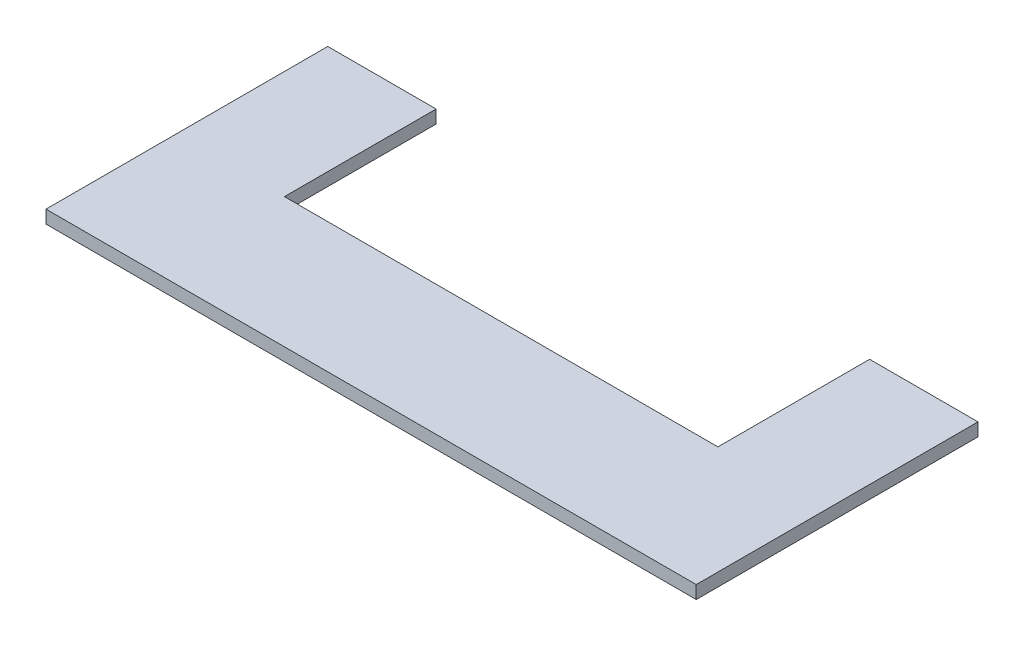
ISO-10303-21;
HEADER;
FILE_DESCRIPTION(('STEP AP214'),'2;1');
FILE_NAME('part.step','',(''),(''),'','','');
FILE_SCHEMA(('AUTOMOTIVE_DESIGN { 1 0 10303 214 1 1 1 1 }'));
ENDSEC;
DATA;
#1=APPLICATION_CONTEXT('core data for automotive mechanical design processes');
#2=APPLICATION_PROTOCOL_DEFINITION('international standard','automotive_design',2000,#1);
#3=PRODUCT_CONTEXT('',#1,'mechanical');
#4=PRODUCT('Part','Part','',(#3));
#5=PRODUCT_RELATED_PRODUCT_CATEGORY('part','',(#4));
#6=PRODUCT_DEFINITION_FORMATION('','',#4);
#7=PRODUCT_DEFINITION_CONTEXT('part definition',#1,'design');
#8=PRODUCT_DEFINITION('design','',#6,#7);
#9=PRODUCT_DEFINITION_SHAPE('','',#8);
#10=(LENGTH_UNIT() NAMED_UNIT(*) SI_UNIT(.MILLI.,.METRE.));
#11=(NAMED_UNIT(*) PLANE_ANGLE_UNIT() SI_UNIT($,.RADIAN.));
#12=(NAMED_UNIT(*) SI_UNIT($,.STERADIAN.) SOLID_ANGLE_UNIT());
#13=UNCERTAINTY_MEASURE_WITH_UNIT(LENGTH_MEASURE(1.E-05),#10,'distance_accuracy_value','');
#14=(GEOMETRIC_REPRESENTATION_CONTEXT(3) GLOBAL_UNCERTAINTY_ASSIGNED_CONTEXT((#13)) GLOBAL_UNIT_ASSIGNED_CONTEXT((#10,
#11,#12)) REPRESENTATION_CONTEXT('',''));
#15=CARTESIAN_POINT('',(0.,0.,0.));
#16=DIRECTION('',(0.,0.,1.));
#17=DIRECTION('',(1.,0.,0.));
#18=AXIS2_PLACEMENT_3D('',#15,#16,#17);
#19=CARTESIAN_POINT('',(150.,6.,65.));
#20=DIRECTION('',(-1.,0.,0.));
#21=DIRECTION('',(0.,0.,1.));
#22=AXIS2_PLACEMENT_3D('',#19,#20,#21);
#23=PLANE('',#22);
#24=DIRECTION('',(0.,0.,-1.));
#25=VECTOR('',#24,1.);
#26=CARTESIAN_POINT('',(150.,0.,65.));
#27=LINE('',#26,#25);
#28=CARTESIAN_POINT('',(150.,0.,65.));
#29=VERTEX_POINT('',#28);
#30=CARTESIAN_POINT('',(150.,0.,-65.));
#31=VERTEX_POINT('',#30);
#32=EDGE_CURVE('E131',#29,#31,#27,.T.);
#33=ORIENTED_EDGE('',*,*,#32,.T.);
#34=DIRECTION('',(0.,-1.,0.));
#35=VECTOR('',#34,1.);
#36=CARTESIAN_POINT('',(150.,6.,-65.));
#37=LINE('',#36,#35);
#38=CARTESIAN_POINT('',(150.,6.,-65.));
#39=VERTEX_POINT('',#38);
#40=EDGE_CURVE('E11',#39,#31,#37,.T.);
#41=ORIENTED_EDGE('',*,*,#40,.F.);
#42=DIRECTION('',(0.,0.,-1.));
#43=VECTOR('',#42,1.);
#44=CARTESIAN_POINT('',(150.,6.,65.));
#45=LINE('',#44,#43);
#46=CARTESIAN_POINT('',(150.,6.,65.));
#47=VERTEX_POINT('',#46);
#48=EDGE_CURVE('E145',#47,#39,#45,.T.);
#49=ORIENTED_EDGE('',*,*,#48,.F.);
#50=DIRECTION('',(0.,-1.,0.));
#51=VECTOR('',#50,1.);
#52=CARTESIAN_POINT('',(150.,6.,65.));
#53=LINE('',#52,#51);
#54=EDGE_CURVE('E127',#47,#29,#53,.T.);
#55=ORIENTED_EDGE('',*,*,#54,.T.);
#56=EDGE_LOOP('',(#33,#41,#49,#55));
#57=FACE_BOUND('',#56,.T.);
#58=ADVANCED_FACE('F35',(#57),#23,.F.);
#59=CARTESIAN_POINT('',(100.,6.,-65.));
#60=DIRECTION('',(0.,0.,1.));
#61=DIRECTION('',(1.,0.,0.));
#62=AXIS2_PLACEMENT_3D('',#59,#60,#61);
#63=PLANE('',#62);
#64=DIRECTION('',(-1.,0.,0.));
#65=VECTOR('',#64,1.);
#66=CARTESIAN_POINT('',(100.,0.,-65.));
#67=LINE('',#66,#65);
#68=CARTESIAN_POINT('',(100.,0.,-65.));
#69=VERTEX_POINT('',#68);
#70=EDGE_CURVE('E134',#31,#69,#67,.T.);
#71=ORIENTED_EDGE('',*,*,#70,.T.);
#72=DIRECTION('',(0.,-1.,0.));
#73=VECTOR('',#72,1.);
#74=CARTESIAN_POINT('',(100.,6.,-65.));
#75=LINE('',#74,#73);
#76=CARTESIAN_POINT('',(100.,6.,-65.));
#77=VERTEX_POINT('',#76);
#78=EDGE_CURVE('E43',#77,#69,#75,.T.);
#79=ORIENTED_EDGE('',*,*,#78,.F.);
#80=DIRECTION('',(-1.,0.,0.));
#81=VECTOR('',#80,1.);
#82=CARTESIAN_POINT('',(100.,6.,-65.));
#83=LINE('',#82,#81);
#84=EDGE_CURVE('E94',#39,#77,#83,.T.);
#85=ORIENTED_EDGE('',*,*,#84,.F.);
#86=ORIENTED_EDGE('',*,*,#40,.T.);
#87=EDGE_LOOP('',(#71,#79,#85,#86));
#88=FACE_BOUND('',#87,.T.);
#89=ADVANCED_FACE('F180',(#88),#63,.F.);
#90=CARTESIAN_POINT('',(100.,6.,-65.));
#91=DIRECTION('',(1.,0.,0.));
#92=DIRECTION('',(0.,0.,-1.));
#93=AXIS2_PLACEMENT_3D('',#90,#91,#92);
#94=PLANE('',#93);
#95=DIRECTION('',(0.,0.,1.));
#96=VECTOR('',#95,1.);
#97=CARTESIAN_POINT('',(100.,0.,-65.));
#98=LINE('',#97,#96);
#99=CARTESIAN_POINT('',(100.,0.,5.00000000000002));
#100=VERTEX_POINT('',#99);
#101=EDGE_CURVE('E136',#69,#100,#98,.T.);
#102=ORIENTED_EDGE('',*,*,#101,.T.);
#103=DIRECTION('',(0.,-1.,0.));
#104=VECTOR('',#103,1.);
#105=CARTESIAN_POINT('',(100.,6.,5.00000000000002));
#106=LINE('',#105,#104);
#107=CARTESIAN_POINT('',(100.,6.,5.00000000000002));
#108=VERTEX_POINT('',#107);
#109=EDGE_CURVE('E152',#108,#100,#106,.T.);
#110=ORIENTED_EDGE('',*,*,#109,.F.);
#111=DIRECTION('',(0.,0.,1.));
#112=VECTOR('',#111,1.);
#113=CARTESIAN_POINT('',(100.,6.,-65.));
#114=LINE('',#113,#112);
#115=EDGE_CURVE('E160',#77,#108,#114,.T.);
#116=ORIENTED_EDGE('',*,*,#115,.F.);
#117=ORIENTED_EDGE('',*,*,#78,.T.);
#118=EDGE_LOOP('',(#102,#110,#116,#117));
#119=FACE_BOUND('',#118,.T.);
#120=ADVANCED_FACE('F158',(#119),#94,.F.);
#121=CARTESIAN_POINT('',(100.,6.,5.00000000000002));
#122=DIRECTION('',(0.,0.,1.));
#123=DIRECTION('',(1.,0.,0.));
#124=AXIS2_PLACEMENT_3D('',#121,#122,#123);
#125=PLANE('',#124);
#126=DIRECTION('',(-1.,0.,0.));
#127=VECTOR('',#126,1.);
#128=CARTESIAN_POINT('',(100.,0.,5.00000000000002));
#129=LINE('',#128,#127);
#130=CARTESIAN_POINT('',(-100.,0.,5.));
#131=VERTEX_POINT('',#130);
#132=EDGE_CURVE('E138',#100,#131,#129,.T.);
#133=ORIENTED_EDGE('',*,*,#132,.T.);
#134=DIRECTION('',(0.,-1.,0.));
#135=VECTOR('',#134,1.);
#136=CARTESIAN_POINT('',(-100.,6.,5.));
#137=LINE('',#136,#135);
#138=CARTESIAN_POINT('',(-100.,6.,5.));
#139=VERTEX_POINT('',#138);
#140=EDGE_CURVE('E149',#139,#131,#137,.T.);
#141=ORIENTED_EDGE('',*,*,#140,.F.);
#142=DIRECTION('',(-1.,0.,0.));
#143=VECTOR('',#142,1.);
#144=CARTESIAN_POINT('',(100.,6.,5.00000000000002));
#145=LINE('',#144,#143);
#146=EDGE_CURVE('E172',#108,#139,#145,.T.);
#147=ORIENTED_EDGE('',*,*,#146,.F.);
#148=ORIENTED_EDGE('',*,*,#109,.T.);
#149=EDGE_LOOP('',(#133,#141,#147,#148));
#150=FACE_BOUND('',#149,.T.);
#151=ADVANCED_FACE('F168',(#150),#125,.F.);
#152=CARTESIAN_POINT('',(-100.,6.,-65.));
#153=DIRECTION('',(-1.,0.,0.));
#154=DIRECTION('',(0.,0.,1.));
#155=AXIS2_PLACEMENT_3D('',#152,#153,#154);
#156=PLANE('',#155);
#157=DIRECTION('',(0.,0.,-1.));
#158=VECTOR('',#157,1.);
#159=CARTESIAN_POINT('',(-100.,0.,-65.));
#160=LINE('',#159,#158);
#161=CARTESIAN_POINT('',(-100.,0.,-65.));
#162=VERTEX_POINT('',#161);
#163=EDGE_CURVE('E140',#131,#162,#160,.T.);
#164=ORIENTED_EDGE('',*,*,#163,.T.);
#165=DIRECTION('',(0.,-1.,0.));
#166=VECTOR('',#165,1.);
#167=CARTESIAN_POINT('',(-100.,6.,-65.));
#168=LINE('',#167,#166);
#169=CARTESIAN_POINT('',(-100.,6.,-65.));
#170=VERTEX_POINT('',#169);
#171=EDGE_CURVE('E122',#170,#162,#168,.T.);
#172=ORIENTED_EDGE('',*,*,#171,.F.);
#173=DIRECTION('',(0.,0.,-1.));
#174=VECTOR('',#173,1.);
#175=CARTESIAN_POINT('',(-100.,6.,-65.));
#176=LINE('',#175,#174);
#177=EDGE_CURVE('E113',#139,#170,#176,.T.);
#178=ORIENTED_EDGE('',*,*,#177,.F.);
#179=ORIENTED_EDGE('',*,*,#140,.T.);
#180=EDGE_LOOP('',(#164,#172,#178,#179));
#181=FACE_BOUND('',#180,.T.);
#182=ADVANCED_FACE('F171',(#181),#156,.F.);
#183=CARTESIAN_POINT('',(-150.,6.,-65.));
#184=DIRECTION('',(0.,0.,1.));
#185=DIRECTION('',(1.,0.,0.));
#186=AXIS2_PLACEMENT_3D('',#183,#184,#185);
#187=PLANE('',#186);
#188=DIRECTION('',(-1.,0.,0.));
#189=VECTOR('',#188,1.);
#190=CARTESIAN_POINT('',(-150.,0.,-65.));
#191=LINE('',#190,#189);
#192=CARTESIAN_POINT('',(-150.,0.,-65.));
#193=VERTEX_POINT('',#192);
#194=EDGE_CURVE('E121',#162,#193,#191,.T.);
#195=ORIENTED_EDGE('',*,*,#194,.T.);
#196=DIRECTION('',(0.,-1.,0.));
#197=VECTOR('',#196,1.);
#198=CARTESIAN_POINT('',(-150.,6.,-65.));
#199=LINE('',#198,#197);
#200=CARTESIAN_POINT('',(-150.,6.,-65.));
#201=VERTEX_POINT('',#200);
#202=EDGE_CURVE('E118',#201,#193,#199,.T.);
#203=ORIENTED_EDGE('',*,*,#202,.F.);
#204=DIRECTION('',(-1.,0.,0.));
#205=VECTOR('',#204,1.);
#206=CARTESIAN_POINT('',(-150.,6.,-65.));
#207=LINE('',#206,#205);
#208=EDGE_CURVE('E107',#170,#201,#207,.T.);
#209=ORIENTED_EDGE('',*,*,#208,.F.);
#210=ORIENTED_EDGE('',*,*,#171,.T.);
#211=EDGE_LOOP('',(#195,#203,#209,#210));
#212=FACE_BOUND('',#211,.T.);
#213=ADVANCED_FACE('F119',(#212),#187,.F.);
#214=CARTESIAN_POINT('',(-150.,6.,65.));
#215=DIRECTION('',(1.,0.,0.));
#216=DIRECTION('',(0.,0.,-1.));
#217=AXIS2_PLACEMENT_3D('',#214,#215,#216);
#218=PLANE('',#217);
#219=DIRECTION('',(0.,0.,1.));
#220=VECTOR('',#219,1.);
#221=CARTESIAN_POINT('',(-150.,0.,65.));
#222=LINE('',#221,#220);
#223=CARTESIAN_POINT('',(-150.,0.,65.));
#224=VERTEX_POINT('',#223);
#225=EDGE_CURVE('E80',#193,#224,#222,.T.);
#226=ORIENTED_EDGE('',*,*,#225,.T.);
#227=DIRECTION('',(0.,-1.,0.));
#228=VECTOR('',#227,1.);
#229=CARTESIAN_POINT('',(-150.,6.,65.));
#230=LINE('',#229,#228);
#231=CARTESIAN_POINT('',(-150.,6.,65.));
#232=VERTEX_POINT('',#231);
#233=EDGE_CURVE('E123',#232,#224,#230,.T.);
#234=ORIENTED_EDGE('',*,*,#233,.F.);
#235=DIRECTION('',(0.,0.,1.));
#236=VECTOR('',#235,1.);
#237=CARTESIAN_POINT('',(-150.,6.,65.));
#238=LINE('',#237,#236);
#239=EDGE_CURVE('E111',#201,#232,#238,.T.);
#240=ORIENTED_EDGE('',*,*,#239,.F.);
#241=ORIENTED_EDGE('',*,*,#202,.T.);
#242=EDGE_LOOP('',(#226,#234,#240,#241));
#243=FACE_BOUND('',#242,.T.);
#244=ADVANCED_FACE('F125',(#243),#218,.F.);
#245=CARTESIAN_POINT('',(-150.,6.,65.));
#246=DIRECTION('',(0.,0.,-1.));
#247=DIRECTION('',(-1.,0.,0.));
#248=AXIS2_PLACEMENT_3D('',#245,#246,#247);
#249=PLANE('',#248);
#250=DIRECTION('',(1.,0.,0.));
#251=VECTOR('',#250,1.);
#252=CARTESIAN_POINT('',(-150.,0.,65.));
#253=LINE('',#252,#251);
#254=EDGE_CURVE('E86',#224,#29,#253,.T.);
#255=ORIENTED_EDGE('',*,*,#254,.T.);
#256=ORIENTED_EDGE('',*,*,#54,.F.);
#257=DIRECTION('',(1.,0.,0.));
#258=VECTOR('',#257,1.);
#259=CARTESIAN_POINT('',(-150.,6.,65.));
#260=LINE('',#259,#258);
#261=EDGE_CURVE('E51',#232,#47,#260,.T.);
#262=ORIENTED_EDGE('',*,*,#261,.F.);
#263=ORIENTED_EDGE('',*,*,#233,.T.);
#264=EDGE_LOOP('',(#255,#256,#262,#263));
#265=FACE_BOUND('',#264,.T.);
#266=ADVANCED_FACE('F196',(#265),#249,.F.);
#267=CARTESIAN_POINT('',(0.,6.,0.));
#268=DIRECTION('',(0.,-1.,0.));
#269=DIRECTION('',(0.,0.,-1.));
#270=AXIS2_PLACEMENT_3D('',#267,#268,#269);
#271=PLANE('',#270);
#272=ORIENTED_EDGE('',*,*,#48,.T.);
#273=ORIENTED_EDGE('',*,*,#84,.T.);
#274=ORIENTED_EDGE('',*,*,#115,.T.);
#275=ORIENTED_EDGE('',*,*,#146,.T.);
#276=ORIENTED_EDGE('',*,*,#177,.T.);
#277=ORIENTED_EDGE('',*,*,#208,.T.);
#278=ORIENTED_EDGE('',*,*,#239,.T.);
#279=ORIENTED_EDGE('',*,*,#261,.T.);
#280=EDGE_LOOP('',(#272,#273,#274,#275,#276,#277,#278,#279));
#281=FACE_BOUND('',#280,.T.);
#282=ADVANCED_FACE('F109',(#281),#271,.F.);
#283=CARTESIAN_POINT('',(0.,0.,0.));
#284=DIRECTION('',(0.,-1.,0.));
#285=DIRECTION('',(0.,0.,-1.));
#286=AXIS2_PLACEMENT_3D('',#283,#284,#285);
#287=PLANE('',#286);
#288=ORIENTED_EDGE('',*,*,#32,.F.);
#289=ORIENTED_EDGE('',*,*,#254,.F.);
#290=ORIENTED_EDGE('',*,*,#225,.F.);
#291=ORIENTED_EDGE('',*,*,#194,.F.);
#292=ORIENTED_EDGE('',*,*,#163,.F.);
#293=ORIENTED_EDGE('',*,*,#132,.F.);
#294=ORIENTED_EDGE('',*,*,#101,.F.);
#295=ORIENTED_EDGE('',*,*,#70,.F.);
#296=EDGE_LOOP('',(#288,#289,#290,#291,#292,#293,#294,#295));
#297=FACE_BOUND('',#296,.T.);
#298=ADVANCED_FACE('F164',(#297),#287,.T.);
#299=CLOSED_SHELL('',(#58,#89,#120,#151,#182,#213,#244,#266,#282,#298));
#300=MANIFOLD_SOLID_BREP('B2',#299);
#301=ADVANCED_BREP_SHAPE_REPRESENTATION('',(#18,#300),#14);
#302=SHAPE_DEFINITION_REPRESENTATION(#9,#301);
ENDSEC;
END-ISO-10303-21;
